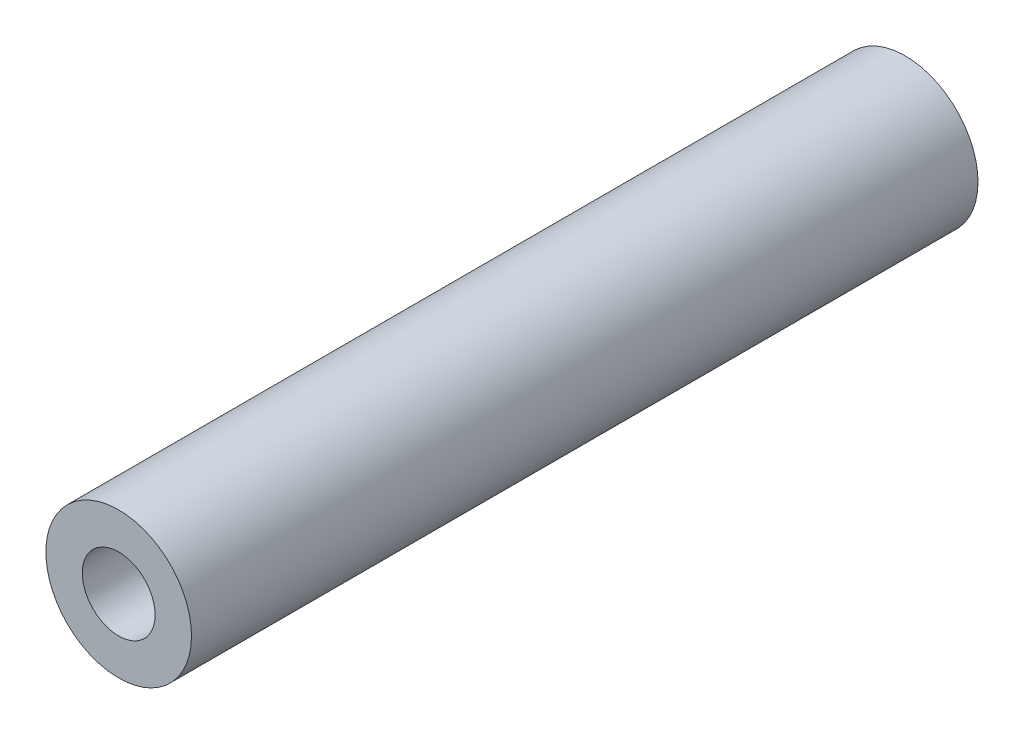
ISO-10303-21;
HEADER;
FILE_DESCRIPTION(('STEP AP214'),'2;1');
FILE_NAME('part.step','',(''),(''),'','','');
FILE_SCHEMA(('AUTOMOTIVE_DESIGN { 1 0 10303 214 1 1 1 1 }'));
ENDSEC;
DATA;
#1=APPLICATION_CONTEXT('core data for automotive mechanical design processes');
#2=APPLICATION_PROTOCOL_DEFINITION('international standard','automotive_design',2000,#1);
#3=PRODUCT_CONTEXT('',#1,'mechanical');
#4=PRODUCT('Part','Part','',(#3));
#5=PRODUCT_RELATED_PRODUCT_CATEGORY('part','',(#4));
#6=PRODUCT_DEFINITION_FORMATION('','',#4);
#7=PRODUCT_DEFINITION_CONTEXT('part definition',#1,'design');
#8=PRODUCT_DEFINITION('design','',#6,#7);
#9=PRODUCT_DEFINITION_SHAPE('','',#8);
#10=(LENGTH_UNIT() NAMED_UNIT(*) SI_UNIT(.MILLI.,.METRE.));
#11=(NAMED_UNIT(*) PLANE_ANGLE_UNIT() SI_UNIT($,.RADIAN.));
#12=(NAMED_UNIT(*) SI_UNIT($,.STERADIAN.) SOLID_ANGLE_UNIT());
#13=UNCERTAINTY_MEASURE_WITH_UNIT(LENGTH_MEASURE(1.E-05),#10,'distance_accuracy_value','');
#14=(GEOMETRIC_REPRESENTATION_CONTEXT(3) GLOBAL_UNCERTAINTY_ASSIGNED_CONTEXT((#13)) GLOBAL_UNIT_ASSIGNED_CONTEXT((#10,
#11,#12)) REPRESENTATION_CONTEXT('',''));
#15=CARTESIAN_POINT('',(0.,0.,0.));
#16=DIRECTION('',(0.,0.,1.));
#17=DIRECTION('',(1.,0.,0.));
#18=AXIS2_PLACEMENT_3D('',#15,#16,#17);
#19=CARTESIAN_POINT('',(0.,0.,10.8));
#20=DIRECTION('',(0.,0.,1.));
#21=DIRECTION('',(1.,0.,0.));
#22=AXIS2_PLACEMENT_3D('',#19,#20,#21);
#23=PLANE('',#22);
#24=CARTESIAN_POINT('',(0.,0.,10.8));
#25=DIRECTION('',(0.,0.,1.));
#26=DIRECTION('',(1.,0.,0.));
#27=AXIS2_PLACEMENT_3D('',#24,#25,#26);
#28=CIRCLE('',#27,1.);
#29=CARTESIAN_POINT('',(1.,0.,10.8));
#30=VERTEX_POINT('',#29);
#31=EDGE_CURVE('E10',#30,#30,#28,.T.);
#32=ORIENTED_EDGE('',*,*,#31,.T.);
#33=EDGE_LOOP('',(#32));
#34=FACE_BOUND('',#33,.T.);
#35=CARTESIAN_POINT('',(0.,0.,10.8));
#36=DIRECTION('',(0.,0.,1.));
#37=DIRECTION('',(1.,0.,0.));
#38=AXIS2_PLACEMENT_3D('',#35,#36,#37);
#39=CIRCLE('',#38,0.5);
#40=CARTESIAN_POINT('',(0.5,0.,10.8));
#41=VERTEX_POINT('',#40);
#42=EDGE_CURVE('E45',#41,#41,#39,.T.);
#43=ORIENTED_EDGE('',*,*,#42,.F.);
#44=EDGE_LOOP('',(#43));
#45=FACE_BOUND('',#44,.T.);
#46=ADVANCED_FACE('F34',(#34,#45),#23,.T.);
#47=CARTESIAN_POINT('',(0.,0.,0.));
#48=DIRECTION('',(0.,0.,1.));
#49=DIRECTION('',(1.,0.,0.));
#50=AXIS2_PLACEMENT_3D('',#47,#48,#49);
#51=PLANE('',#50);
#52=CARTESIAN_POINT('',(0.,0.,0.));
#53=DIRECTION('',(0.,0.,1.));
#54=DIRECTION('',(1.,0.,0.));
#55=AXIS2_PLACEMENT_3D('',#52,#53,#54);
#56=CIRCLE('',#55,1.);
#57=CARTESIAN_POINT('',(1.,0.,0.));
#58=VERTEX_POINT('',#57);
#59=EDGE_CURVE('E38',#58,#58,#56,.T.);
#60=ORIENTED_EDGE('',*,*,#59,.F.);
#61=EDGE_LOOP('',(#60));
#62=FACE_BOUND('',#61,.T.);
#63=CARTESIAN_POINT('',(0.,0.,0.));
#64=DIRECTION('',(0.,0.,1.));
#65=DIRECTION('',(1.,0.,0.));
#66=AXIS2_PLACEMENT_3D('',#63,#64,#65);
#67=CIRCLE('',#66,0.5);
#68=CARTESIAN_POINT('',(0.5,0.,0.));
#69=VERTEX_POINT('',#68);
#70=EDGE_CURVE('E47',#69,#69,#67,.T.);
#71=ORIENTED_EDGE('',*,*,#70,.T.);
#72=EDGE_LOOP('',(#71));
#73=FACE_BOUND('',#72,.T.);
#74=ADVANCED_FACE('F57',(#62,#73),#51,.F.);
#75=CARTESIAN_POINT('',(0.,0.,10.8));
#76=DIRECTION('',(0.,0.,-1.));
#77=DIRECTION('',(-1.,0.,0.));
#78=AXIS2_PLACEMENT_3D('',#75,#76,#77);
#79=CYLINDRICAL_SURFACE('',#78,1.);
#80=ORIENTED_EDGE('',*,*,#31,.F.);
#81=EDGE_LOOP('',(#80));
#82=FACE_BOUND('',#81,.T.);
#83=ORIENTED_EDGE('',*,*,#59,.T.);
#84=EDGE_LOOP('',(#83));
#85=FACE_BOUND('',#84,.T.);
#86=ADVANCED_FACE('F36',(#82,#85),#79,.T.);
#87=CARTESIAN_POINT('',(0.,0.,10.8));
#88=DIRECTION('',(0.,0.,-1.));
#89=DIRECTION('',(-1.,0.,0.));
#90=AXIS2_PLACEMENT_3D('',#87,#88,#89);
#91=CYLINDRICAL_SURFACE('',#90,0.5);
#92=ORIENTED_EDGE('',*,*,#42,.T.);
#93=EDGE_LOOP('',(#92));
#94=FACE_BOUND('',#93,.T.);
#95=ORIENTED_EDGE('',*,*,#70,.F.);
#96=EDGE_LOOP('',(#95));
#97=FACE_BOUND('',#96,.T.);
#98=ADVANCED_FACE('F53',(#94,#97),#91,.F.);
#99=CLOSED_SHELL('',(#46,#74,#86,#98));
#100=MANIFOLD_SOLID_BREP('B2',#99);
#101=ADVANCED_BREP_SHAPE_REPRESENTATION('',(#18,#100),#14);
#102=SHAPE_DEFINITION_REPRESENTATION(#9,#101);
ENDSEC;
END-ISO-10303-21;
